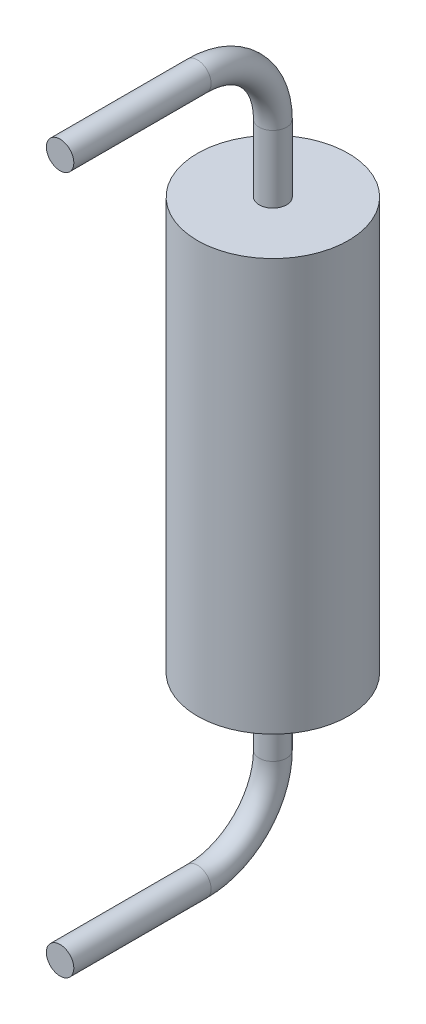
ISO-10303-21;
HEADER;
FILE_DESCRIPTION(('STEP AP214'),'2;1');
FILE_NAME('part.step','',(''),(''),'','','');
FILE_SCHEMA(('AUTOMOTIVE_DESIGN { 1 0 10303 214 1 1 1 1 }'));
ENDSEC;
DATA;
#1=APPLICATION_CONTEXT('core data for automotive mechanical design processes');
#2=APPLICATION_PROTOCOL_DEFINITION('international standard','automotive_design',2000,#1);
#3=PRODUCT_CONTEXT('',#1,'mechanical');
#4=PRODUCT('Part','Part','',(#3));
#5=PRODUCT_RELATED_PRODUCT_CATEGORY('part','',(#4));
#6=PRODUCT_DEFINITION_FORMATION('','',#4);
#7=PRODUCT_DEFINITION_CONTEXT('part definition',#1,'design');
#8=PRODUCT_DEFINITION('design','',#6,#7);
#9=PRODUCT_DEFINITION_SHAPE('','',#8);
#10=(LENGTH_UNIT() NAMED_UNIT(*) SI_UNIT(.MILLI.,.METRE.));
#11=(NAMED_UNIT(*) PLANE_ANGLE_UNIT() SI_UNIT($,.RADIAN.));
#12=(NAMED_UNIT(*) SI_UNIT($,.STERADIAN.) SOLID_ANGLE_UNIT());
#13=UNCERTAINTY_MEASURE_WITH_UNIT(LENGTH_MEASURE(1.E-05),#10,'distance_accuracy_value','');
#14=(GEOMETRIC_REPRESENTATION_CONTEXT(3) GLOBAL_UNCERTAINTY_ASSIGNED_CONTEXT((#13)) GLOBAL_UNIT_ASSIGNED_CONTEXT((#10,
#11,#12)) REPRESENTATION_CONTEXT('',''));
#15=CARTESIAN_POINT('',(0.,0.,0.));
#16=DIRECTION('',(0.,0.,1.));
#17=DIRECTION('',(1.,0.,0.));
#18=AXIS2_PLACEMENT_3D('',#15,#16,#17);
#19=CARTESIAN_POINT('',(0.,-3.,0.));
#20=DIRECTION('',(0.,1.,0.));
#21=DIRECTION('',(0.,0.,1.));
#22=AXIS2_PLACEMENT_3D('',#19,#20,#21);
#23=CYLINDRICAL_SURFACE('',#22,1.1);
#24=CARTESIAN_POINT('',(0.,-3.,0.));
#25=DIRECTION('',(0.,1.,0.));
#26=DIRECTION('',(0.,0.,1.));
#27=AXIS2_PLACEMENT_3D('',#24,#25,#26);
#28=CIRCLE('',#27,1.1);
#29=CARTESIAN_POINT('',(0.,-3.,1.1));
#30=VERTEX_POINT('',#29);
#31=EDGE_CURVE('E11',#30,#30,#28,.T.);
#32=ORIENTED_EDGE('',*,*,#31,.T.);
#33=EDGE_LOOP('',(#32));
#34=FACE_BOUND('',#33,.T.);
#35=CARTESIAN_POINT('',(0.,3.,0.));
#36=DIRECTION('',(0.,1.,0.));
#37=DIRECTION('',(0.,0.,1.));
#38=AXIS2_PLACEMENT_3D('',#35,#36,#37);
#39=CIRCLE('',#38,1.1);
#40=CARTESIAN_POINT('',(0.,3.,1.1));
#41=VERTEX_POINT('',#40);
#42=EDGE_CURVE('E74',#41,#41,#39,.T.);
#43=ORIENTED_EDGE('',*,*,#42,.F.);
#44=EDGE_LOOP('',(#43));
#45=FACE_BOUND('',#44,.T.);
#46=ADVANCED_FACE('F67',(#34,#45),#23,.T.);
#47=CARTESIAN_POINT('',(0.,-3.,0.));
#48=DIRECTION('',(0.,1.,0.));
#49=DIRECTION('',(0.,0.,1.));
#50=AXIS2_PLACEMENT_3D('',#47,#48,#49);
#51=PLANE('',#50);
#52=CARTESIAN_POINT('',(0.,-3.,0.));
#53=DIRECTION('',(0.,-1.,0.));
#54=DIRECTION('',(-1.,0.,0.));
#55=AXIS2_PLACEMENT_3D('',#52,#53,#54);
#56=CIRCLE('',#55,0.2);
#57=CARTESIAN_POINT('',(-0.2,-3.,0.));
#58=VERTEX_POINT('',#57);
#59=EDGE_CURVE('E110',#58,#58,#56,.F.);
#60=ORIENTED_EDGE('',*,*,#59,.T.);
#61=EDGE_LOOP('',(#60));
#62=FACE_BOUND('',#61,.T.);
#63=ORIENTED_EDGE('',*,*,#31,.F.);
#64=EDGE_LOOP('',(#63));
#65=FACE_BOUND('',#64,.T.);
#66=ADVANCED_FACE('F115',(#62,#65),#51,.F.);
#67=CARTESIAN_POINT('',(0.,3.,0.));
#68=DIRECTION('',(0.,1.,0.));
#69=DIRECTION('',(0.,0.,1.));
#70=AXIS2_PLACEMENT_3D('',#67,#68,#69);
#71=PLANE('',#70);
#72=CARTESIAN_POINT('',(0.,3.,0.));
#73=DIRECTION('',(0.,-1.,0.));
#74=DIRECTION('',(-1.,0.,0.));
#75=AXIS2_PLACEMENT_3D('',#72,#73,#74);
#76=CIRCLE('',#75,0.2);
#77=CARTESIAN_POINT('',(-0.2,3.,0.));
#78=VERTEX_POINT('',#77);
#79=EDGE_CURVE('E94',#78,#78,#76,.T.);
#80=ORIENTED_EDGE('',*,*,#79,.T.);
#81=EDGE_LOOP('',(#80));
#82=FACE_BOUND('',#81,.T.);
#83=ORIENTED_EDGE('',*,*,#42,.T.);
#84=EDGE_LOOP('',(#83));
#85=FACE_BOUND('',#84,.T.);
#86=ADVANCED_FACE('F139',(#82,#85),#71,.T.);
#87=CARTESIAN_POINT('',(0.,5.08,3.1));
#88=DIRECTION('',(0.,0.,-1.));
#89=DIRECTION('',(-1.,0.,0.));
#90=AXIS2_PLACEMENT_3D('',#87,#88,#89);
#91=PLANE('',#90);
#92=CARTESIAN_POINT('',(0.,5.08,3.1));
#93=DIRECTION('',(0.,0.,-1.));
#94=DIRECTION('',(-1.,0.,0.));
#95=AXIS2_PLACEMENT_3D('',#92,#93,#94);
#96=CIRCLE('',#95,0.2);
#97=CARTESIAN_POINT('',(-0.2,5.08,3.1));
#98=VERTEX_POINT('',#97);
#99=EDGE_CURVE('E79',#98,#98,#96,.T.);
#100=ORIENTED_EDGE('',*,*,#99,.F.);
#101=EDGE_LOOP('',(#100));
#102=FACE_BOUND('',#101,.T.);
#103=ADVANCED_FACE('F144',(#102),#91,.F.);
#104=CARTESIAN_POINT('',(0.,3.,0.));
#105=DIRECTION('',(0.,1.,0.));
#106=DIRECTION('',(0.,0.,1.));
#107=AXIS2_PLACEMENT_3D('',#104,#105,#106);
#108=CYLINDRICAL_SURFACE('',#107,0.2);
#109=CARTESIAN_POINT('',(0.,3.98,0.));
#110=DIRECTION('',(0.,-1.,0.));
#111=DIRECTION('',(-1.,0.,0.));
#112=AXIS2_PLACEMENT_3D('',#109,#110,#111);
#113=CIRCLE('',#112,0.2);
#114=CARTESIAN_POINT('',(0.,3.98,-0.2));
#115=VERTEX_POINT('',#114);
#116=EDGE_CURVE('E90',#115,#115,#113,.T.);
#117=ORIENTED_EDGE('',*,*,#116,.T.);
#118=EDGE_LOOP('',(#117));
#119=FACE_BOUND('',#118,.T.);
#120=ORIENTED_EDGE('',*,*,#79,.F.);
#121=EDGE_LOOP('',(#120));
#122=FACE_BOUND('',#121,.T.);
#123=ADVANCED_FACE('F150',(#119,#122),#108,.T.);
#124=CARTESIAN_POINT('',(0.,3.98,1.1));
#125=DIRECTION('',(1.,0.,0.));
#126=DIRECTION('',(0.,0.,-1.));
#127=AXIS2_PLACEMENT_3D('',#124,#125,#126);
#128=TOROIDAL_SURFACE('',#127,1.1,0.2);
#129=CARTESIAN_POINT('',(0.,5.08,1.1));
#130=DIRECTION('',(0.,0.,-1.));
#131=DIRECTION('',(-1.,0.,0.));
#132=AXIS2_PLACEMENT_3D('',#129,#130,#131);
#133=CIRCLE('',#132,0.2);
#134=CARTESIAN_POINT('',(0.,5.28,1.1));
#135=VERTEX_POINT('',#134);
#136=EDGE_CURVE('E84',#135,#135,#133,.T.);
#137=CARTESIAN_POINT('',(0.,3.98,1.1));
#138=DIRECTION('',(1.,0.,0.));
#139=DIRECTION('',(0.,0.,-1.));
#140=AXIS2_PLACEMENT_3D('',#137,#138,#139);
#141=CIRCLE('',#140,1.3);
#142=EDGE_CURVE('',#115,#135,#141,.T.);
#143=ORIENTED_EDGE('',*,*,#116,.F.);
#144=ORIENTED_EDGE('',*,*,#136,.T.);
#145=ORIENTED_EDGE('',*,*,#142,.T.);
#146=ORIENTED_EDGE('',*,*,#142,.F.);
#147=EDGE_LOOP('',(#143,#145,#144,#146));
#148=FACE_BOUND('',#147,.T.);
#149=ADVANCED_FACE('F153',(#148),#128,.T.);
#150=CARTESIAN_POINT('',(0.,5.08,1.1));
#151=DIRECTION('',(0.,0.,1.));
#152=DIRECTION('',(1.,0.,0.));
#153=AXIS2_PLACEMENT_3D('',#150,#151,#152);
#154=CYLINDRICAL_SURFACE('',#153,0.2);
#155=ORIENTED_EDGE('',*,*,#99,.T.);
#156=EDGE_LOOP('',(#155));
#157=FACE_BOUND('',#156,.T.);
#158=ORIENTED_EDGE('',*,*,#136,.F.);
#159=EDGE_LOOP('',(#158));
#160=FACE_BOUND('',#159,.T.);
#161=ADVANCED_FACE('F131',(#157,#160),#154,.T.);
#162=CARTESIAN_POINT('',(0.,-5.08,3.1));
#163=DIRECTION('',(0.,0.,-1.));
#164=DIRECTION('',(-1.,0.,0.));
#165=AXIS2_PLACEMENT_3D('',#162,#163,#164);
#166=PLANE('',#165);
#167=CARTESIAN_POINT('',(0.,-5.08,3.1));
#168=DIRECTION('',(0.,0.,1.));
#169=DIRECTION('',(-1.,0.,0.));
#170=AXIS2_PLACEMENT_3D('',#167,#168,#169);
#171=CIRCLE('',#170,0.2);
#172=CARTESIAN_POINT('',(-0.2,-5.08,3.1));
#173=VERTEX_POINT('',#172);
#174=EDGE_CURVE('E98',#173,#173,#171,.F.);
#175=ORIENTED_EDGE('',*,*,#174,.F.);
#176=EDGE_LOOP('',(#175));
#177=FACE_BOUND('',#176,.T.);
#178=ADVANCED_FACE('F121',(#177),#166,.F.);
#179=CARTESIAN_POINT('',(0.,-3.,0.));
#180=DIRECTION('',(0.,-1.,0.));
#181=DIRECTION('',(0.,0.,-1.));
#182=AXIS2_PLACEMENT_3D('',#179,#180,#181);
#183=CYLINDRICAL_SURFACE('',#182,0.2);
#184=CARTESIAN_POINT('',(0.,-3.98,0.));
#185=DIRECTION('',(0.,-1.,0.));
#186=DIRECTION('',(-1.,0.,0.));
#187=AXIS2_PLACEMENT_3D('',#184,#185,#186);
#188=CIRCLE('',#187,0.2);
#189=CARTESIAN_POINT('',(0.,-3.98,-0.2));
#190=VERTEX_POINT('',#189);
#191=EDGE_CURVE('E106',#190,#190,#188,.F.);
#192=ORIENTED_EDGE('',*,*,#191,.T.);
#193=EDGE_LOOP('',(#192));
#194=FACE_BOUND('',#193,.T.);
#195=ORIENTED_EDGE('',*,*,#59,.F.);
#196=EDGE_LOOP('',(#195));
#197=FACE_BOUND('',#196,.T.);
#198=ADVANCED_FACE('F118',(#194,#197),#183,.T.);
#199=CARTESIAN_POINT('',(0.,-3.98,1.1));
#200=DIRECTION('',(-1.,0.,0.));
#201=DIRECTION('',(0.,0.,1.));
#202=AXIS2_PLACEMENT_3D('',#199,#200,#201);
#203=TOROIDAL_SURFACE('',#202,1.1,0.2);
#204=CARTESIAN_POINT('',(0.,-5.08,1.1));
#205=DIRECTION('',(0.,0.,1.));
#206=DIRECTION('',(-1.,0.,0.));
#207=AXIS2_PLACEMENT_3D('',#204,#205,#206);
#208=CIRCLE('',#207,0.2);
#209=CARTESIAN_POINT('',(0.,-5.28,1.1));
#210=VERTEX_POINT('',#209);
#211=EDGE_CURVE('E102',#210,#210,#208,.F.);
#212=CARTESIAN_POINT('',(0.,-3.98,1.1));
#213=DIRECTION('',(-1.,0.,0.));
#214=DIRECTION('',(0.,0.,1.));
#215=AXIS2_PLACEMENT_3D('',#212,#213,#214);
#216=CIRCLE('',#215,1.3);
#217=EDGE_CURVE('',#190,#210,#216,.T.);
#218=ORIENTED_EDGE('',*,*,#191,.F.);
#219=ORIENTED_EDGE('',*,*,#211,.T.);
#220=ORIENTED_EDGE('',*,*,#217,.T.);
#221=ORIENTED_EDGE('',*,*,#217,.F.);
#222=EDGE_LOOP('',(#218,#220,#219,#221));
#223=FACE_BOUND('',#222,.T.);
#224=ADVANCED_FACE('F120',(#223),#203,.T.);
#225=CARTESIAN_POINT('',(0.,-5.08,1.1));
#226=DIRECTION('',(0.,0.,1.));
#227=DIRECTION('',(1.,0.,0.));
#228=AXIS2_PLACEMENT_3D('',#225,#226,#227);
#229=CYLINDRICAL_SURFACE('',#228,0.2);
#230=ORIENTED_EDGE('',*,*,#174,.T.);
#231=EDGE_LOOP('',(#230));
#232=FACE_BOUND('',#231,.T.);
#233=ORIENTED_EDGE('',*,*,#211,.F.);
#234=EDGE_LOOP('',(#233));
#235=FACE_BOUND('',#234,.T.);
#236=ADVANCED_FACE('F128',(#232,#235),#229,.T.);
#237=CLOSED_SHELL('',(#46,#66,#86,#103,#123,#149,#161,#178,#198,#224,#236));
#238=MANIFOLD_SOLID_BREP('B2',#237);
#239=ADVANCED_BREP_SHAPE_REPRESENTATION('',(#18,#238),#14);
#240=SHAPE_DEFINITION_REPRESENTATION(#9,#239);
ENDSEC;
END-ISO-10303-21;
